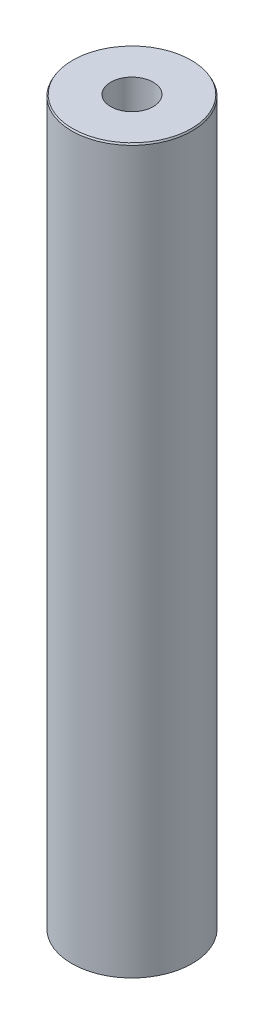
ISO-10303-21;
HEADER;
FILE_DESCRIPTION(('STEP AP214'),'2;1');
FILE_NAME('part.step','',(''),(''),'','','');
FILE_SCHEMA(('AUTOMOTIVE_DESIGN { 1 0 10303 214 1 1 1 1 }'));
ENDSEC;
DATA;
#1=APPLICATION_CONTEXT('core data for automotive mechanical design processes');
#2=APPLICATION_PROTOCOL_DEFINITION('international standard','automotive_design',2000,#1);
#3=PRODUCT_CONTEXT('',#1,'mechanical');
#4=PRODUCT('Part','Part','',(#3));
#5=PRODUCT_RELATED_PRODUCT_CATEGORY('part','',(#4));
#6=PRODUCT_DEFINITION_FORMATION('','',#4);
#7=PRODUCT_DEFINITION_CONTEXT('part definition',#1,'design');
#8=PRODUCT_DEFINITION('design','',#6,#7);
#9=PRODUCT_DEFINITION_SHAPE('','',#8);
#10=(LENGTH_UNIT() NAMED_UNIT(*) SI_UNIT(.MILLI.,.METRE.));
#11=(NAMED_UNIT(*) PLANE_ANGLE_UNIT() SI_UNIT($,.RADIAN.));
#12=(NAMED_UNIT(*) SI_UNIT($,.STERADIAN.) SOLID_ANGLE_UNIT());
#13=UNCERTAINTY_MEASURE_WITH_UNIT(LENGTH_MEASURE(1.E-05),#10,'distance_accuracy_value','');
#14=(GEOMETRIC_REPRESENTATION_CONTEXT(3) GLOBAL_UNCERTAINTY_ASSIGNED_CONTEXT((#13)) GLOBAL_UNIT_ASSIGNED_CONTEXT((#10,
#11,#12)) REPRESENTATION_CONTEXT('',''));
#15=CARTESIAN_POINT('',(0.,0.,0.));
#16=DIRECTION('',(0.,0.,1.));
#17=DIRECTION('',(1.,0.,0.));
#18=AXIS2_PLACEMENT_3D('',#15,#16,#17);
#19=CARTESIAN_POINT('',(0.,330.494195405999,0.));
#20=DIRECTION('',(0.,-1.,0.));
#21=DIRECTION('',(0.,0.,-1.));
#22=AXIS2_PLACEMENT_3D('',#19,#20,#21);
#23=CYLINDRICAL_SURFACE('',#22,27.5);
#24=CARTESIAN_POINT('',(0.,329.768982065319,0.));
#25=DIRECTION('',(0.,1.,0.));
#26=DIRECTION('',(0.,0.,1.));
#27=AXIS2_PLACEMENT_3D('',#24,#25,#26);
#28=CIRCLE('',#27,27.5);
#29=CARTESIAN_POINT('',(0.,329.768982065319,27.5));
#30=VERTEX_POINT('',#29);
#31=EDGE_CURVE('E50',#30,#30,#28,.F.);
#32=ORIENTED_EDGE('',*,*,#31,.T.);
#33=EDGE_LOOP('',(#32));
#34=FACE_BOUND('',#33,.T.);
#35=CARTESIAN_POINT('',(0.,0.418702117461478,0.));
#36=DIRECTION('',(0.,1.,0.));
#37=DIRECTION('',(0.,0.,1.));
#38=AXIS2_PLACEMENT_3D('',#35,#36,#37);
#39=CIRCLE('',#38,27.5);
#40=CARTESIAN_POINT('',(0.,0.418702117461478,27.5));
#41=VERTEX_POINT('',#40);
#42=EDGE_CURVE('E51',#41,#41,#39,.T.);
#43=ORIENTED_EDGE('',*,*,#42,.T.);
#44=EDGE_LOOP('',(#43));
#45=FACE_BOUND('',#44,.T.);
#46=ADVANCED_FACE('F39',(#34,#45),#23,.T.);
#47=CARTESIAN_POINT('',(0.,330.494195405999,0.));
#48=DIRECTION('',(0.,1.,0.));
#49=DIRECTION('',(0.,0.,1.));
#50=AXIS2_PLACEMENT_3D('',#47,#48,#49);
#51=PLANE('',#50);
#52=CARTESIAN_POINT('',(0.,330.494195405999,0.));
#53=DIRECTION('',(0.,1.,0.));
#54=DIRECTION('',(0.,0.,1.));
#55=AXIS2_PLACEMENT_3D('',#52,#53,#54);
#56=CIRCLE('',#55,27.0812978825385);
#57=CARTESIAN_POINT('',(0.,330.494195405999,27.0812978825385));
#58=VERTEX_POINT('',#57);
#59=EDGE_CURVE('E54',#58,#58,#56,.T.);
#60=ORIENTED_EDGE('',*,*,#59,.T.);
#61=EDGE_LOOP('',(#60));
#62=FACE_BOUND('',#61,.T.);
#63=CARTESIAN_POINT('',(0.,330.494195405999,0.));
#64=DIRECTION('',(0.,1.,0.));
#65=DIRECTION('',(0.,0.,1.));
#66=AXIS2_PLACEMENT_3D('',#63,#64,#65);
#67=CIRCLE('',#66,9.69838326953297);
#68=CARTESIAN_POINT('',(0.,330.494195405999,9.69838326953297));
#69=VERTEX_POINT('',#68);
#70=EDGE_CURVE('E58',#69,#69,#67,.T.);
#71=ORIENTED_EDGE('',*,*,#70,.F.);
#72=EDGE_LOOP('',(#71));
#73=FACE_BOUND('',#72,.T.);
#74=ADVANCED_FACE('F69',(#62,#73),#51,.T.);
#75=CARTESIAN_POINT('',(0.,0.,0.));
#76=DIRECTION('',(0.,1.,0.));
#77=DIRECTION('',(0.,0.,1.));
#78=AXIS2_PLACEMENT_3D('',#75,#76,#77);
#79=PLANE('',#78);
#80=CARTESIAN_POINT('',(0.,0.,0.));
#81=DIRECTION('',(0.,1.,0.));
#82=DIRECTION('',(0.,0.,1.));
#83=AXIS2_PLACEMENT_3D('',#80,#81,#82);
#84=CIRCLE('',#83,26.77478665932);
#85=CARTESIAN_POINT('',(0.,0.,26.77478665932));
#86=VERTEX_POINT('',#85);
#87=EDGE_CURVE('E10',#86,#86,#84,.F.);
#88=ORIENTED_EDGE('',*,*,#87,.T.);
#89=EDGE_LOOP('',(#88));
#90=FACE_BOUND('',#89,.T.);
#91=CARTESIAN_POINT('',(0.,0.,0.));
#92=DIRECTION('',(0.,1.,0.));
#93=DIRECTION('',(0.,0.,1.));
#94=AXIS2_PLACEMENT_3D('',#91,#92,#93);
#95=CIRCLE('',#94,9.69838326953297);
#96=CARTESIAN_POINT('',(0.,0.,9.69838326953297));
#97=VERTEX_POINT('',#96);
#98=EDGE_CURVE('E63',#97,#97,#95,.T.);
#99=ORIENTED_EDGE('',*,*,#98,.T.);
#100=EDGE_LOOP('',(#99));
#101=FACE_BOUND('',#100,.T.);
#102=ADVANCED_FACE('F75',(#90,#101),#79,.F.);
#103=CARTESIAN_POINT('',(0.,330.494195405999,0.));
#104=DIRECTION('',(0.,-1.,0.));
#105=DIRECTION('',(0.,0.,-1.));
#106=AXIS2_PLACEMENT_3D('',#103,#104,#105);
#107=CYLINDRICAL_SURFACE('',#106,9.69838326953297);
#108=ORIENTED_EDGE('',*,*,#70,.T.);
#109=EDGE_LOOP('',(#108));
#110=FACE_BOUND('',#109,.T.);
#111=ORIENTED_EDGE('',*,*,#98,.F.);
#112=EDGE_LOOP('',(#111));
#113=FACE_BOUND('',#112,.T.);
#114=ADVANCED_FACE('F70',(#110,#113),#107,.F.);
#115=CARTESIAN_POINT('',(0.,330.494195405999,0.));
#116=DIRECTION('',(0.,-1.,0.));
#117=DIRECTION('',(0.,0.,-1.));
#118=AXIS2_PLACEMENT_3D('',#115,#116,#117);
#119=CONICAL_SURFACE('',#118,27.0812978825385,0.523598775598281);
#120=ORIENTED_EDGE('',*,*,#31,.F.);
#121=EDGE_LOOP('',(#120));
#122=FACE_BOUND('',#121,.T.);
#123=ORIENTED_EDGE('',*,*,#59,.F.);
#124=EDGE_LOOP('',(#123));
#125=FACE_BOUND('',#124,.T.);
#126=ADVANCED_FACE('F81',(#122,#125),#119,.T.);
#127=CARTESIAN_POINT('',(0.,0.418702117461478,0.));
#128=DIRECTION('',(0.,1.,0.));
#129=DIRECTION('',(0.,0.,1.));
#130=AXIS2_PLACEMENT_3D('',#127,#128,#129);
#131=CONICAL_SURFACE('',#130,27.5,1.04719755119661);
#132=ORIENTED_EDGE('',*,*,#87,.F.);
#133=EDGE_LOOP('',(#132));
#134=FACE_BOUND('',#133,.T.);
#135=ORIENTED_EDGE('',*,*,#42,.F.);
#136=EDGE_LOOP('',(#135));
#137=FACE_BOUND('',#136,.T.);
#138=ADVANCED_FACE('F45',(#134,#137),#131,.T.);
#139=CLOSED_SHELL('',(#46,#74,#102,#114,#126,#138));
#140=MANIFOLD_SOLID_BREP('B2',#139);
#141=ADVANCED_BREP_SHAPE_REPRESENTATION('',(#18,#140),#14);
#142=SHAPE_DEFINITION_REPRESENTATION(#9,#141);
ENDSEC;
END-ISO-10303-21;
